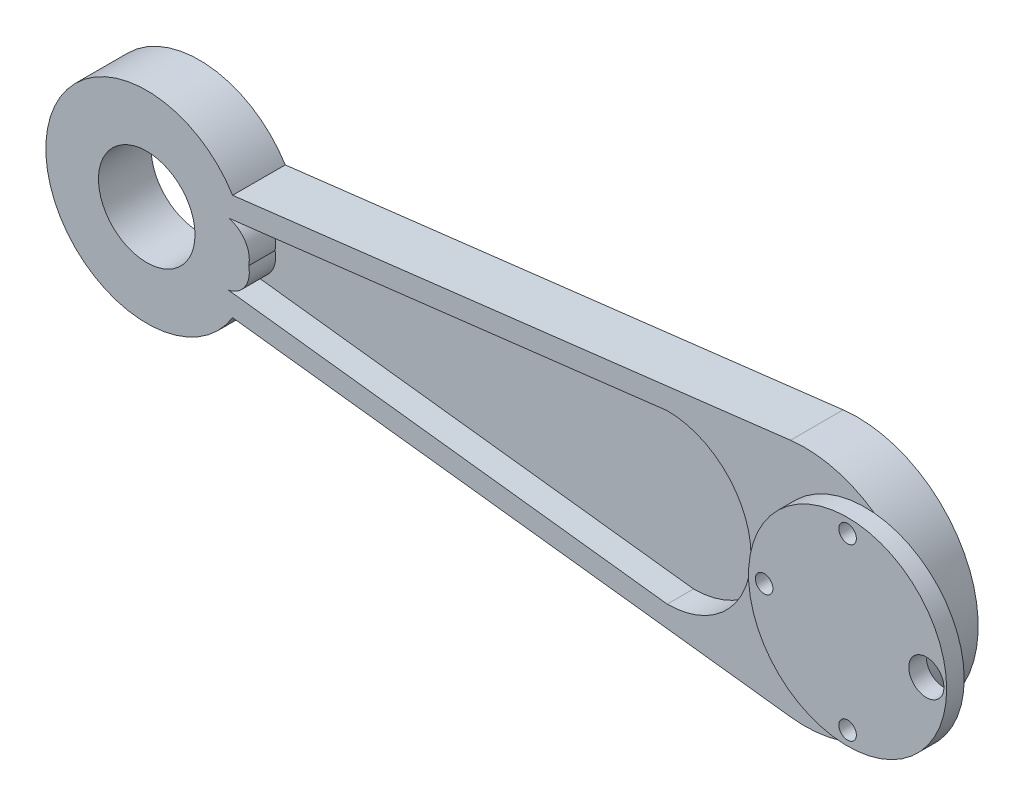
ISO-10303-21;
HEADER;
FILE_DESCRIPTION(('STEP AP214'),'2;1');
FILE_NAME('part.step','',(''),(''),'','','');
FILE_SCHEMA(('AUTOMOTIVE_DESIGN { 1 0 10303 214 1 1 1 1 }'));
ENDSEC;
DATA;
#1=APPLICATION_CONTEXT('core data for automotive mechanical design processes');
#2=APPLICATION_PROTOCOL_DEFINITION('international standard','automotive_design',2000,#1);
#3=PRODUCT_CONTEXT('',#1,'mechanical');
#4=PRODUCT('Part','Part','',(#3));
#5=PRODUCT_RELATED_PRODUCT_CATEGORY('part','',(#4));
#6=PRODUCT_DEFINITION_FORMATION('','',#4);
#7=PRODUCT_DEFINITION_CONTEXT('part definition',#1,'design');
#8=PRODUCT_DEFINITION('design','',#6,#7);
#9=PRODUCT_DEFINITION_SHAPE('','',#8);
#10=(LENGTH_UNIT() NAMED_UNIT(*) SI_UNIT(.MILLI.,.METRE.));
#11=(NAMED_UNIT(*) PLANE_ANGLE_UNIT() SI_UNIT($,.RADIAN.));
#12=(NAMED_UNIT(*) SI_UNIT($,.STERADIAN.) SOLID_ANGLE_UNIT());
#13=UNCERTAINTY_MEASURE_WITH_UNIT(LENGTH_MEASURE(1.E-05),#10,'distance_accuracy_value','');
#14=(GEOMETRIC_REPRESENTATION_CONTEXT(3) GLOBAL_UNCERTAINTY_ASSIGNED_CONTEXT((#13)) GLOBAL_UNIT_ASSIGNED_CONTEXT((#10,
#11,#12)) REPRESENTATION_CONTEXT('',''));
#15=CARTESIAN_POINT('',(0.,0.,0.));
#16=DIRECTION('',(0.,0.,1.));
#17=DIRECTION('',(1.,0.,0.));
#18=AXIS2_PLACEMENT_3D('',#15,#16,#17);
#19=CARTESIAN_POINT('',(9.69578719259024,0.,0.));
#20=DIRECTION('',(0.,0.,1.));
#21=DIRECTION('',(1.,0.,0.));
#22=AXIS2_PLACEMENT_3D('',#19,#20,#21);
#23=PLANE('',#22);
#24=CARTESIAN_POINT('',(9.69578719259024,0.,0.));
#25=DIRECTION('',(0.,0.,1.));
#26=DIRECTION('',(1.,0.,0.));
#27=AXIS2_PLACEMENT_3D('',#24,#25,#26);
#28=CIRCLE('',#27,27.5);
#29=CARTESIAN_POINT('',(6.42598445737751,-27.304915126636,0.));
#30=VERTEX_POINT('',#29);
#31=CARTESIAN_POINT('',(6.42598445737751,27.304915126636,0.));
#32=VERTEX_POINT('',#31);
#33=EDGE_CURVE('E182',#30,#32,#28,.T.);
#34=ORIENTED_EDGE('',*,*,#33,.F.);
#35=DIRECTION('',(0.992906004604945,-0.118901917644099,0.));
#36=VECTOR('',#35,1.);
#37=CARTESIAN_POINT('',(6.42598445737751,-27.304915126636,0.));
#38=LINE('',#37,#36);
#39=CARTESIAN_POINT('',(-120.730550627406,-12.0777377378,0.));
#40=VERTEX_POINT('',#39);
#41=EDGE_CURVE('E194',#40,#30,#38,.T.);
#42=ORIENTED_EDGE('',*,*,#41,.F.);
#43=CARTESIAN_POINT('',(-140.30421280741,0.,0.));
#44=DIRECTION('',(0.,0.,1.));
#45=DIRECTION('',(1.,0.,0.));
#46=AXIS2_PLACEMENT_3D('',#43,#44,#45);
#47=CIRCLE('',#46,23.);
#48=CARTESIAN_POINT('',(-120.730550627406,12.0777377378,0.));
#49=VERTEX_POINT('',#48);
#50=EDGE_CURVE('E192',#49,#40,#47,.T.);
#51=ORIENTED_EDGE('',*,*,#50,.F.);
#52=DIRECTION('',(-0.992906004604945,-0.118901917644099,0.));
#53=VECTOR('',#52,1.);
#54=CARTESIAN_POINT('',(6.42598445737751,27.304915126636,0.));
#55=LINE('',#54,#53);
#56=EDGE_CURVE('E190',#32,#49,#55,.T.);
#57=ORIENTED_EDGE('',*,*,#56,.F.);
#58=EDGE_LOOP('',(#34,#42,#51,#57));
#59=FACE_BOUND('',#58,.T.);
#60=CARTESIAN_POINT('',(-140.30421280741,0.,0.));
#61=DIRECTION('',(0.,0.,1.));
#62=DIRECTION('',(1.,0.,0.));
#63=AXIS2_PLACEMENT_3D('',#60,#61,#62);
#64=CIRCLE('',#63,11.);
#65=CARTESIAN_POINT('',(-129.30421280741,0.,0.));
#66=VERTEX_POINT('',#65);
#67=EDGE_CURVE('E142',#66,#66,#64,.T.);
#68=ORIENTED_EDGE('',*,*,#67,.T.);
#69=EDGE_LOOP('',(#68));
#70=FACE_BOUND('',#69,.T.);
#71=CARTESIAN_POINT('',(4.41668994822247,0.,0.));
#72=DIRECTION('',(0.,0.,1.));
#73=DIRECTION('',(1.,0.,0.));
#74=AXIS2_PLACEMENT_3D('',#71,#72,#73);
#75=CIRCLE('',#74,2.);
#76=CARTESIAN_POINT('',(6.41668994822247,0.,0.));
#77=VERTEX_POINT('',#76);
#78=EDGE_CURVE('E133',#77,#77,#75,.T.);
#79=ORIENTED_EDGE('',*,*,#78,.T.);
#80=EDGE_LOOP('',(#79));
#81=FACE_BOUND('',#80,.T.);
#82=CARTESIAN_POINT('',(23.4332464093947,19.3922579257773,0.));
#83=DIRECTION('',(0.,0.,-1.));
#84=DIRECTION('',(-1.,0.,0.));
#85=AXIS2_PLACEMENT_3D('',#82,#83,#84);
#86=CIRCLE('',#85,2.);
#87=CARTESIAN_POINT('',(21.4332464093947,19.3922579257773,0.));
#88=VERTEX_POINT('',#87);
#89=EDGE_CURVE('E294',#88,#88,#86,.T.);
#90=ORIENTED_EDGE('',*,*,#89,.F.);
#91=EDGE_LOOP('',(#90));
#92=FACE_BOUND('',#91,.T.);
#93=CARTESIAN_POINT('',(23.4332464093947,-19.3922579257773,0.));
#94=DIRECTION('',(0.,0.,1.));
#95=DIRECTION('',(1.,0.,0.));
#96=AXIS2_PLACEMENT_3D('',#93,#94,#95);
#97=CIRCLE('',#96,2.);
#98=CARTESIAN_POINT('',(25.4332464093947,-19.3922579257773,0.));
#99=VERTEX_POINT('',#98);
#100=EDGE_CURVE('E300',#99,#99,#97,.T.);
#101=ORIENTED_EDGE('',*,*,#100,.T.);
#102=EDGE_LOOP('',(#101));
#103=FACE_BOUND('',#102,.T.);
#104=ADVANCED_FACE('F35',(#59,#70,#81,#92,#103),#23,.F.);
#105=CARTESIAN_POINT('',(23.4332464093947,0.,16.));
#106=DIRECTION('',(0.,0.,1.));
#107=DIRECTION('',(1.,0.,0.));
#108=AXIS2_PLACEMENT_3D('',#105,#106,#107);
#109=PLANE('',#108);
#110=CARTESIAN_POINT('',(41.3772664111266,0.,16.));
#111=DIRECTION('',(0.,0.,1.));
#112=DIRECTION('',(1.,0.,0.));
#113=AXIS2_PLACEMENT_3D('',#110,#111,#112);
#114=CIRCLE('',#113,4.);
#115=CARTESIAN_POINT('',(45.3772664111266,0.,16.));
#116=VERTEX_POINT('',#115);
#117=EDGE_CURVE('E291',#116,#116,#114,.T.);
#118=ORIENTED_EDGE('',*,*,#117,.F.);
#119=EDGE_LOOP('',(#118));
#120=FACE_BOUND('',#119,.T.);
#121=CARTESIAN_POINT('',(23.4332464093947,19.3922579257773,16.));
#122=DIRECTION('',(0.,0.,-1.));
#123=DIRECTION('',(-1.,0.,0.));
#124=AXIS2_PLACEMENT_3D('',#121,#122,#123);
#125=CIRCLE('',#124,2.);
#126=CARTESIAN_POINT('',(21.4332464093947,19.3922579257773,16.));
#127=VERTEX_POINT('',#126);
#128=EDGE_CURVE('E296',#127,#127,#125,.T.);
#129=ORIENTED_EDGE('',*,*,#128,.T.);
#130=EDGE_LOOP('',(#129));
#131=FACE_BOUND('',#130,.T.);
#132=CARTESIAN_POINT('',(4.41668994822247,0.,16.));
#133=DIRECTION('',(0.,0.,1.));
#134=DIRECTION('',(1.,0.,0.));
#135=AXIS2_PLACEMENT_3D('',#132,#133,#134);
#136=CIRCLE('',#135,2.);
#137=CARTESIAN_POINT('',(6.41668994822247,0.,16.));
#138=VERTEX_POINT('',#137);
#139=EDGE_CURVE('E303',#138,#138,#136,.T.);
#140=ORIENTED_EDGE('',*,*,#139,.F.);
#141=EDGE_LOOP('',(#140));
#142=FACE_BOUND('',#141,.T.);
#143=CARTESIAN_POINT('',(23.4332464093947,0.,16.));
#144=DIRECTION('',(0.,0.,1.));
#145=DIRECTION('',(1.,0.,0.));
#146=AXIS2_PLACEMENT_3D('',#143,#144,#145);
#147=CIRCLE('',#146,22.579968685631);
#148=CARTESIAN_POINT('',(46.0132150950257,0.,16.));
#149=VERTEX_POINT('',#148);
#150=EDGE_CURVE('E136',#149,#149,#147,.T.);
#151=ORIENTED_EDGE('',*,*,#150,.T.);
#152=EDGE_LOOP('',(#151));
#153=FACE_BOUND('',#152,.T.);
#154=CARTESIAN_POINT('',(23.4332464093947,-19.3922579257773,16.));
#155=DIRECTION('',(0.,0.,1.));
#156=DIRECTION('',(1.,0.,0.));
#157=AXIS2_PLACEMENT_3D('',#154,#155,#156);
#158=CIRCLE('',#157,2.);
#159=CARTESIAN_POINT('',(25.4332464093947,-19.3922579257773,16.));
#160=VERTEX_POINT('',#159);
#161=EDGE_CURVE('E304',#160,#160,#158,.T.);
#162=ORIENTED_EDGE('',*,*,#161,.F.);
#163=EDGE_LOOP('',(#162));
#164=FACE_BOUND('',#163,.T.);
#165=ADVANCED_FACE('F223',(#120,#131,#142,#153,#164),#109,.T.);
#166=CARTESIAN_POINT('',(9.69578719259024,0.,12.));
#167=DIRECTION('',(0.,0.,1.));
#168=DIRECTION('',(1.,0.,0.));
#169=AXIS2_PLACEMENT_3D('',#166,#167,#168);
#170=PLANE('',#169);
#171=CARTESIAN_POINT('',(23.4332464093947,0.,12.));
#172=DIRECTION('',(0.,0.,1.));
#173=DIRECTION('',(1.,0.,0.));
#174=AXIS2_PLACEMENT_3D('',#171,#172,#173);
#175=CIRCLE('',#174,22.579968685631);
#176=CARTESIAN_POINT('',(25.5325148225815,22.4821720030221,12.));
#177=VERTEX_POINT('',#176);
#178=CARTESIAN_POINT('',(25.5325148225815,-22.4821720030221,12.));
#179=VERTEX_POINT('',#178);
#180=EDGE_CURVE('E51',#177,#179,#175,.T.);
#181=ORIENTED_EDGE('',*,*,#180,.F.);
#182=CARTESIAN_POINT('',(9.69578719259024,0.,12.));
#183=DIRECTION('',(0.,0.,1.));
#184=DIRECTION('',(1.,0.,0.));
#185=AXIS2_PLACEMENT_3D('',#182,#183,#184);
#186=CIRCLE('',#185,27.5);
#187=CARTESIAN_POINT('',(6.42598445737751,27.304915126636,12.));
#188=VERTEX_POINT('',#187);
#189=EDGE_CURVE('E123',#177,#188,#186,.T.);
#190=ORIENTED_EDGE('',*,*,#189,.T.);
#191=DIRECTION('',(-0.992906004604945,-0.118901917644099,0.));
#192=VECTOR('',#191,1.);
#193=CARTESIAN_POINT('',(6.42598445737751,27.304915126636,12.));
#194=LINE('',#193,#192);
#195=CARTESIAN_POINT('',(-120.730550627406,12.0777377378,12.));
#196=VERTEX_POINT('',#195);
#197=EDGE_CURVE('E120',#188,#196,#194,.T.);
#198=ORIENTED_EDGE('',*,*,#197,.T.);
#199=CARTESIAN_POINT('',(-140.30421280741,0.,12.));
#200=DIRECTION('',(0.,0.,1.));
#201=DIRECTION('',(1.,0.,0.));
#202=AXIS2_PLACEMENT_3D('',#199,#200,#201);
#203=CIRCLE('',#202,23.);
#204=CARTESIAN_POINT('',(-120.730550627406,-12.0777377378,12.));
#205=VERTEX_POINT('',#204);
#206=EDGE_CURVE('E185',#196,#205,#203,.T.);
#207=ORIENTED_EDGE('',*,*,#206,.T.);
#208=DIRECTION('',(0.992906004604945,-0.118901917644099,0.));
#209=VECTOR('',#208,1.);
#210=CARTESIAN_POINT('',(6.42598445737751,-27.304915126636,12.));
#211=LINE('',#210,#209);
#212=CARTESIAN_POINT('',(6.42598445737751,-27.304915126636,12.));
#213=VERTEX_POINT('',#212);
#214=EDGE_CURVE('E116',#205,#213,#211,.T.);
#215=ORIENTED_EDGE('',*,*,#214,.T.);
#216=EDGE_CURVE('E111',#213,#179,#186,.T.);
#217=ORIENTED_EDGE('',*,*,#216,.T.);
#218=EDGE_LOOP('',(#181,#190,#198,#207,#215,#217));
#219=FACE_BOUND('',#218,.T.);
#220=CARTESIAN_POINT('',(-140.30421280741,0.,12.));
#221=DIRECTION('',(0.,0.,1.));
#222=DIRECTION('',(1.,0.,0.));
#223=AXIS2_PLACEMENT_3D('',#220,#221,#222);
#224=CIRCLE('',#223,11.);
#225=CARTESIAN_POINT('',(-129.30421280741,0.,12.));
#226=VERTEX_POINT('',#225);
#227=EDGE_CURVE('E138',#226,#226,#224,.T.);
#228=ORIENTED_EDGE('',*,*,#227,.F.);
#229=EDGE_LOOP('',(#228));
#230=FACE_BOUND('',#229,.T.);
#231=DIRECTION('',(0.992906004604945,-0.118901917644099,0.));
#232=VECTOR('',#231,1.);
#233=CARTESIAN_POINT('',(-121.670322634586,-7.12237792326735,12.));
#234=LINE('',#233,#232);
#235=CARTESIAN_POINT('',(-121.670322634586,-7.12237792326735,12.));
#236=VERTEX_POINT('',#235);
#237=CARTESIAN_POINT('',(-21.6789657167423,-19.0964862781641,12.));
#238=VERTEX_POINT('',#237);
#239=EDGE_CURVE('E150',#236,#238,#234,.T.);
#240=ORIENTED_EDGE('',*,*,#239,.F.);
#241=CARTESIAN_POINT('',(-122.925918752607,-1.25559611802046,12.));
#242=DIRECTION('',(0.,0.,1.));
#243=DIRECTION('',(1.,0.,0.));
#244=AXIS2_PLACEMENT_3D('',#241,#242,#243);
#245=CIRCLE('',#244,5.99963751921431);
#246=CARTESIAN_POINT('',(-117.05913694736,0.,12.));
#247=VERTEX_POINT('',#246);
#248=EDGE_CURVE('E59',#236,#247,#245,.T.);
#249=ORIENTED_EDGE('',*,*,#248,.T.);
#250=CARTESIAN_POINT('',(-122.925918752607,1.25559611802046,12.));
#251=DIRECTION('',(0.,0.,-1.));
#252=DIRECTION('',(-1.,0.,0.));
#253=AXIS2_PLACEMENT_3D('',#250,#251,#252);
#254=CIRCLE('',#253,5.99963751921431);
#255=CARTESIAN_POINT('',(-121.670322634586,7.12237792326735,12.));
#256=VERTEX_POINT('',#255);
#257=EDGE_CURVE('E163',#256,#247,#254,.T.);
#258=ORIENTED_EDGE('',*,*,#257,.F.);
#259=DIRECTION('',(0.992906004604945,0.118901917644099,0.));
#260=VECTOR('',#259,1.);
#261=CARTESIAN_POINT('',(-121.670322634586,7.12237792326735,12.));
#262=LINE('',#261,#260);
#263=CARTESIAN_POINT('',(-21.6789657167423,19.0964862781641,12.));
#264=VERTEX_POINT('',#263);
#265=EDGE_CURVE('E166',#256,#264,#262,.T.);
#266=ORIENTED_EDGE('',*,*,#265,.T.);
#267=CARTESIAN_POINT('',(-21.6703226345828,0.,12.));
#268=DIRECTION('',(0.,0.,1.));
#269=DIRECTION('',(1.,0.,0.));
#270=AXIS2_PLACEMENT_3D('',#267,#268,#269);
#271=CIRCLE('',#270,19.0964882340963);
#272=EDGE_CURVE('E169',#238,#264,#271,.T.);
#273=ORIENTED_EDGE('',*,*,#272,.F.);
#274=EDGE_LOOP('',(#240,#249,#258,#266,#273));
#275=FACE_BOUND('',#274,.T.);
#276=ADVANCED_FACE('F113',(#219,#230,#275),#170,.T.);
#277=CARTESIAN_POINT('',(9.69578719259024,0.,12.));
#278=DIRECTION('',(0.,0.,-1.));
#279=DIRECTION('',(-1.,0.,0.));
#280=AXIS2_PLACEMENT_3D('',#277,#278,#279);
#281=CYLINDRICAL_SURFACE('',#280,27.5);
#282=ORIENTED_EDGE('',*,*,#33,.T.);
#283=DIRECTION('',(0.,0.,-1.));
#284=VECTOR('',#283,1.);
#285=CARTESIAN_POINT('',(6.42598445737751,27.304915126636,12.));
#286=LINE('',#285,#284);
#287=EDGE_CURVE('E11',#188,#32,#286,.T.);
#288=ORIENTED_EDGE('',*,*,#287,.F.);
#289=ORIENTED_EDGE('',*,*,#189,.F.);
#290=EDGE_CURVE('E121',#179,#177,#186,.T.);
#291=ORIENTED_EDGE('',*,*,#290,.F.);
#292=ORIENTED_EDGE('',*,*,#216,.F.);
#293=DIRECTION('',(0.,0.,-1.));
#294=VECTOR('',#293,1.);
#295=CARTESIAN_POINT('',(6.42598445737751,-27.304915126636,12.));
#296=LINE('',#295,#294);
#297=EDGE_CURVE('E188',#213,#30,#296,.T.);
#298=ORIENTED_EDGE('',*,*,#297,.T.);
#299=EDGE_LOOP('',(#282,#288,#289,#291,#292,#298));
#300=FACE_BOUND('',#299,.T.);
#301=ADVANCED_FACE('F37',(#300),#281,.T.);
#302=CARTESIAN_POINT('',(6.42598445737751,27.304915126636,12.));
#303=DIRECTION('',(0.118901917644099,-0.992906004604945,0.));
#304=DIRECTION('',(0.992906004604946,0.118901917644099,0.));
#305=AXIS2_PLACEMENT_3D('',#302,#303,#304);
#306=PLANE('',#305);
#307=ORIENTED_EDGE('',*,*,#56,.T.);
#308=DIRECTION('',(0.,0.,-1.));
#309=VECTOR('',#308,1.);
#310=CARTESIAN_POINT('',(-120.730550627406,12.0777377378,12.));
#311=LINE('',#310,#309);
#312=EDGE_CURVE('E44',#196,#49,#311,.T.);
#313=ORIENTED_EDGE('',*,*,#312,.F.);
#314=ORIENTED_EDGE('',*,*,#197,.F.);
#315=ORIENTED_EDGE('',*,*,#287,.T.);
#316=EDGE_LOOP('',(#307,#313,#314,#315));
#317=FACE_BOUND('',#316,.T.);
#318=ADVANCED_FACE('F215',(#317),#306,.F.);
#319=CARTESIAN_POINT('',(-140.30421280741,0.,12.));
#320=DIRECTION('',(0.,0.,-1.));
#321=DIRECTION('',(-1.,0.,0.));
#322=AXIS2_PLACEMENT_3D('',#319,#320,#321);
#323=CYLINDRICAL_SURFACE('',#322,23.);
#324=ORIENTED_EDGE('',*,*,#50,.T.);
#325=DIRECTION('',(0.,0.,-1.));
#326=VECTOR('',#325,1.);
#327=CARTESIAN_POINT('',(-120.730550627406,-12.0777377378,12.));
#328=LINE('',#327,#326);
#329=EDGE_CURVE('E197',#205,#40,#328,.T.);
#330=ORIENTED_EDGE('',*,*,#329,.F.);
#331=ORIENTED_EDGE('',*,*,#206,.F.);
#332=ORIENTED_EDGE('',*,*,#312,.T.);
#333=EDGE_LOOP('',(#324,#330,#331,#332));
#334=FACE_BOUND('',#333,.T.);
#335=ADVANCED_FACE('F205',(#334),#323,.T.);
#336=CARTESIAN_POINT('',(6.42598445737751,-27.304915126636,12.));
#337=DIRECTION('',(0.118901917644099,0.992906004604945,0.));
#338=DIRECTION('',(-0.992906004604946,0.118901917644099,0.));
#339=AXIS2_PLACEMENT_3D('',#336,#337,#338);
#340=PLANE('',#339);
#341=ORIENTED_EDGE('',*,*,#41,.T.);
#342=ORIENTED_EDGE('',*,*,#297,.F.);
#343=ORIENTED_EDGE('',*,*,#214,.F.);
#344=ORIENTED_EDGE('',*,*,#329,.T.);
#345=EDGE_LOOP('',(#341,#342,#343,#344));
#346=FACE_BOUND('',#345,.T.);
#347=ADVANCED_FACE('F214',(#346),#340,.F.);
#348=CARTESIAN_POINT('',(-122.925918752607,-1.25559611802046,6.));
#349=DIRECTION('',(0.,0.,1.));
#350=DIRECTION('',(1.,0.,0.));
#351=AXIS2_PLACEMENT_3D('',#348,#349,#350);
#352=CYLINDRICAL_SURFACE('',#351,5.99963751921431);
#353=ORIENTED_EDGE('',*,*,#248,.F.);
#354=DIRECTION('',(0.,0.,1.));
#355=VECTOR('',#354,1.);
#356=CARTESIAN_POINT('',(-121.670322634586,-7.12237792326735,6.));
#357=LINE('',#356,#355);
#358=CARTESIAN_POINT('',(-121.670322634586,-7.12237792326735,6.));
#359=VERTEX_POINT('',#358);
#360=EDGE_CURVE('E161',#359,#236,#357,.T.);
#361=ORIENTED_EDGE('',*,*,#360,.F.);
#362=CARTESIAN_POINT('',(-122.925918752607,-1.25559611802046,6.));
#363=DIRECTION('',(0.,0.,1.));
#364=DIRECTION('',(1.,0.,0.));
#365=AXIS2_PLACEMENT_3D('',#362,#363,#364);
#366=CIRCLE('',#365,5.99963751921431);
#367=CARTESIAN_POINT('',(-117.05913694736,0.,6.));
#368=VERTEX_POINT('',#367);
#369=EDGE_CURVE('E147',#359,#368,#366,.T.);
#370=ORIENTED_EDGE('',*,*,#369,.T.);
#371=DIRECTION('',(0.,0.,1.));
#372=VECTOR('',#371,1.);
#373=CARTESIAN_POINT('',(-117.05913694736,0.,6.));
#374=LINE('',#373,#372);
#375=EDGE_CURVE('E181',#368,#247,#374,.T.);
#376=ORIENTED_EDGE('',*,*,#375,.T.);
#377=EDGE_LOOP('',(#353,#361,#370,#376));
#378=FACE_BOUND('',#377,.T.);
#379=ADVANCED_FACE('F234',(#378),#352,.T.);
#380=CARTESIAN_POINT('',(-122.925918752607,1.25559611802046,6.));
#381=DIRECTION('',(0.,0.,1.));
#382=DIRECTION('',(1.,0.,0.));
#383=AXIS2_PLACEMENT_3D('',#380,#381,#382);
#384=CYLINDRICAL_SURFACE('',#383,5.99963751921431);
#385=ORIENTED_EDGE('',*,*,#257,.T.);
#386=ORIENTED_EDGE('',*,*,#375,.F.);
#387=CARTESIAN_POINT('',(-122.925918752607,1.25559611802046,6.));
#388=DIRECTION('',(0.,0.,-1.));
#389=DIRECTION('',(-1.,0.,0.));
#390=AXIS2_PLACEMENT_3D('',#387,#388,#389);
#391=CIRCLE('',#390,5.99963751921431);
#392=CARTESIAN_POINT('',(-121.670322634586,7.12237792326735,6.));
#393=VERTEX_POINT('',#392);
#394=EDGE_CURVE('E149',#393,#368,#391,.T.);
#395=ORIENTED_EDGE('',*,*,#394,.F.);
#396=DIRECTION('',(0.,0.,1.));
#397=VECTOR('',#396,1.);
#398=CARTESIAN_POINT('',(-121.670322634586,7.12237792326735,6.));
#399=LINE('',#398,#397);
#400=EDGE_CURVE('E179',#393,#256,#399,.T.);
#401=ORIENTED_EDGE('',*,*,#400,.T.);
#402=EDGE_LOOP('',(#385,#386,#395,#401));
#403=FACE_BOUND('',#402,.T.);
#404=ADVANCED_FACE('F238',(#403),#384,.T.);
#405=CARTESIAN_POINT('',(-121.670322634586,7.12237792326735,6.));
#406=DIRECTION('',(0.118901917644099,-0.992906004604945,0.));
#407=DIRECTION('',(0.992906004604945,0.118901917644099,0.));
#408=AXIS2_PLACEMENT_3D('',#405,#406,#407);
#409=PLANE('',#408);
#410=ORIENTED_EDGE('',*,*,#265,.F.);
#411=ORIENTED_EDGE('',*,*,#400,.F.);
#412=DIRECTION('',(0.992906004604945,0.118901917644099,0.));
#413=VECTOR('',#412,1.);
#414=CARTESIAN_POINT('',(-121.670322634586,7.12237792326735,6.));
#415=LINE('',#414,#413);
#416=CARTESIAN_POINT('',(-21.6789657167423,19.0964862781641,6.));
#417=VERTEX_POINT('',#416);
#418=EDGE_CURVE('E153',#393,#417,#415,.T.);
#419=ORIENTED_EDGE('',*,*,#418,.T.);
#420=DIRECTION('',(0.,0.,1.));
#421=VECTOR('',#420,1.);
#422=CARTESIAN_POINT('',(-21.6789657167423,19.0964862781641,6.));
#423=LINE('',#422,#421);
#424=EDGE_CURVE('E177',#417,#264,#423,.T.);
#425=ORIENTED_EDGE('',*,*,#424,.T.);
#426=EDGE_LOOP('',(#410,#411,#419,#425));
#427=FACE_BOUND('',#426,.T.);
#428=ADVANCED_FACE('F242',(#427),#409,.T.);
#429=CARTESIAN_POINT('',(-21.6703226345828,0.,6.));
#430=DIRECTION('',(0.,0.,1.));
#431=DIRECTION('',(1.,0.,0.));
#432=AXIS2_PLACEMENT_3D('',#429,#430,#431);
#433=CYLINDRICAL_SURFACE('',#432,19.0964882340963);
#434=ORIENTED_EDGE('',*,*,#272,.T.);
#435=ORIENTED_EDGE('',*,*,#424,.F.);
#436=CARTESIAN_POINT('',(-21.6703226345828,0.,6.));
#437=DIRECTION('',(0.,0.,1.));
#438=DIRECTION('',(1.,0.,0.));
#439=AXIS2_PLACEMENT_3D('',#436,#437,#438);
#440=CIRCLE('',#439,19.0964882340963);
#441=CARTESIAN_POINT('',(-21.6789657167423,-19.0964862781641,6.));
#442=VERTEX_POINT('',#441);
#443=EDGE_CURVE('E155',#442,#417,#440,.T.);
#444=ORIENTED_EDGE('',*,*,#443,.F.);
#445=DIRECTION('',(0.,0.,1.));
#446=VECTOR('',#445,1.);
#447=CARTESIAN_POINT('',(-21.6789657167423,-19.0964862781641,6.));
#448=LINE('',#447,#446);
#449=EDGE_CURVE('E175',#442,#238,#448,.T.);
#450=ORIENTED_EDGE('',*,*,#449,.T.);
#451=EDGE_LOOP('',(#434,#435,#444,#450));
#452=FACE_BOUND('',#451,.T.);
#453=ADVANCED_FACE('F248',(#452),#433,.F.);
#454=CARTESIAN_POINT('',(-121.670322634586,-7.12237792326735,6.));
#455=DIRECTION('',(-0.118901917644099,-0.992906004604945,0.));
#456=DIRECTION('',(0.992906004604945,-0.118901917644099,0.));
#457=AXIS2_PLACEMENT_3D('',#454,#455,#456);
#458=PLANE('',#457);
#459=ORIENTED_EDGE('',*,*,#239,.T.);
#460=ORIENTED_EDGE('',*,*,#449,.F.);
#461=DIRECTION('',(0.992906004604945,-0.118901917644099,0.));
#462=VECTOR('',#461,1.);
#463=CARTESIAN_POINT('',(-121.670322634586,-7.12237792326735,6.));
#464=LINE('',#463,#462);
#465=EDGE_CURVE('E158',#359,#442,#464,.T.);
#466=ORIENTED_EDGE('',*,*,#465,.F.);
#467=ORIENTED_EDGE('',*,*,#360,.T.);
#468=EDGE_LOOP('',(#459,#460,#466,#467));
#469=FACE_BOUND('',#468,.T.);
#470=ADVANCED_FACE('F252',(#469),#458,.F.);
#471=CARTESIAN_POINT('',(-122.925918752607,-1.25559611802046,6.));
#472=DIRECTION('',(0.,0.,1.));
#473=DIRECTION('',(1.,0.,0.));
#474=AXIS2_PLACEMENT_3D('',#471,#472,#473);
#475=PLANE('',#474);
#476=ORIENTED_EDGE('',*,*,#369,.F.);
#477=ORIENTED_EDGE('',*,*,#465,.T.);
#478=ORIENTED_EDGE('',*,*,#443,.T.);
#479=ORIENTED_EDGE('',*,*,#418,.F.);
#480=ORIENTED_EDGE('',*,*,#394,.T.);
#481=EDGE_LOOP('',(#476,#477,#478,#479,#480));
#482=FACE_BOUND('',#481,.T.);
#483=ADVANCED_FACE('F256',(#482),#475,.T.);
#484=CARTESIAN_POINT('',(-140.30421280741,0.,0.));
#485=DIRECTION('',(0.,0.,1.));
#486=DIRECTION('',(1.,0.,0.));
#487=AXIS2_PLACEMENT_3D('',#484,#485,#486);
#488=CYLINDRICAL_SURFACE('',#487,11.);
#489=ORIENTED_EDGE('',*,*,#67,.F.);
#490=EDGE_LOOP('',(#489));
#491=FACE_BOUND('',#490,.T.);
#492=ORIENTED_EDGE('',*,*,#227,.T.);
#493=EDGE_LOOP('',(#492));
#494=FACE_BOUND('',#493,.T.);
#495=ADVANCED_FACE('F260',(#491,#494),#488,.F.);
#496=CARTESIAN_POINT('',(23.4332464093947,0.,12.));
#497=DIRECTION('',(0.,0.,1.));
#498=DIRECTION('',(1.,0.,0.));
#499=AXIS2_PLACEMENT_3D('',#496,#497,#498);
#500=PLANE('',#499);
#501=CARTESIAN_POINT('',(41.3772664111266,0.,12.));
#502=DIRECTION('',(0.,0.,1.));
#503=DIRECTION('',(1.,0.,0.));
#504=AXIS2_PLACEMENT_3D('',#501,#502,#503);
#505=CIRCLE('',#504,4.);
#506=CARTESIAN_POINT('',(45.3772664111266,0.,12.));
#507=VERTEX_POINT('',#506);
#508=EDGE_CURVE('E39',#507,#507,#505,.T.);
#509=ORIENTED_EDGE('',*,*,#508,.T.);
#510=EDGE_LOOP('',(#509));
#511=FACE_BOUND('',#510,.T.);
#512=EDGE_CURVE('E130',#179,#177,#175,.T.);
#513=ORIENTED_EDGE('',*,*,#512,.F.);
#514=ORIENTED_EDGE('',*,*,#290,.T.);
#515=EDGE_LOOP('',(#513,#514));
#516=FACE_BOUND('',#515,.T.);
#517=ADVANCED_FACE('F131',(#511,#516),#500,.F.);
#518=CARTESIAN_POINT('',(23.4332464093947,0.,16.));
#519=DIRECTION('',(0.,0.,-1.));
#520=DIRECTION('',(-1.,0.,0.));
#521=AXIS2_PLACEMENT_3D('',#518,#519,#520);
#522=CYLINDRICAL_SURFACE('',#521,22.579968685631);
#523=ORIENTED_EDGE('',*,*,#150,.F.);
#524=EDGE_LOOP('',(#523));
#525=FACE_BOUND('',#524,.T.);
#526=ORIENTED_EDGE('',*,*,#180,.T.);
#527=ORIENTED_EDGE('',*,*,#512,.T.);
#528=EDGE_LOOP('',(#526,#527));
#529=FACE_BOUND('',#528,.T.);
#530=ADVANCED_FACE('F135',(#525,#529),#522,.T.);
#531=CARTESIAN_POINT('',(4.41668994822247,0.,0.));
#532=DIRECTION('',(0.,0.,1.));
#533=DIRECTION('',(1.,0.,0.));
#534=AXIS2_PLACEMENT_3D('',#531,#532,#533);
#535=CYLINDRICAL_SURFACE('',#534,2.);
#536=ORIENTED_EDGE('',*,*,#78,.F.);
#537=EDGE_LOOP('',(#536));
#538=FACE_BOUND('',#537,.T.);
#539=ORIENTED_EDGE('',*,*,#139,.T.);
#540=EDGE_LOOP('',(#539));
#541=FACE_BOUND('',#540,.T.);
#542=ADVANCED_FACE('F267',(#538,#541),#535,.F.);
#543=CARTESIAN_POINT('',(23.4332464093947,19.3922579257773,0.));
#544=DIRECTION('',(0.,0.,1.));
#545=DIRECTION('',(1.,0.,0.));
#546=AXIS2_PLACEMENT_3D('',#543,#544,#545);
#547=CYLINDRICAL_SURFACE('',#546,2.);
#548=ORIENTED_EDGE('',*,*,#89,.T.);
#549=EDGE_LOOP('',(#548));
#550=FACE_BOUND('',#549,.T.);
#551=ORIENTED_EDGE('',*,*,#128,.F.);
#552=EDGE_LOOP('',(#551));
#553=FACE_BOUND('',#552,.T.);
#554=ADVANCED_FACE('F274',(#550,#553),#547,.F.);
#555=CARTESIAN_POINT('',(23.4332464093947,-19.3922579257773,0.));
#556=DIRECTION('',(0.,0.,1.));
#557=DIRECTION('',(1.,0.,0.));
#558=AXIS2_PLACEMENT_3D('',#555,#556,#557);
#559=CYLINDRICAL_SURFACE('',#558,2.);
#560=ORIENTED_EDGE('',*,*,#100,.F.);
#561=EDGE_LOOP('',(#560));
#562=FACE_BOUND('',#561,.T.);
#563=ORIENTED_EDGE('',*,*,#161,.T.);
#564=EDGE_LOOP('',(#563));
#565=FACE_BOUND('',#564,.T.);
#566=ADVANCED_FACE('F278',(#562,#565),#559,.F.);
#567=CARTESIAN_POINT('',(41.3772664111266,0.,0.));
#568=DIRECTION('',(0.,0.,1.));
#569=DIRECTION('',(1.,0.,0.));
#570=AXIS2_PLACEMENT_3D('',#567,#568,#569);
#571=CYLINDRICAL_SURFACE('',#570,4.);
#572=ORIENTED_EDGE('',*,*,#117,.T.);
#573=EDGE_LOOP('',(#572));
#574=FACE_BOUND('',#573,.T.);
#575=ORIENTED_EDGE('',*,*,#508,.F.);
#576=EDGE_LOOP('',(#575));
#577=FACE_BOUND('',#576,.T.);
#578=ADVANCED_FACE('F282',(#574,#577),#571,.F.);
#579=CLOSED_SHELL('',(#104,#165,#276,#301,#318,#335,#347,#379,#404,#428,#453,#470,#483,#495,
#517,#530,#542,#554,#566,#578));
#580=MANIFOLD_SOLID_BREP('B2',#579);
#581=ADVANCED_BREP_SHAPE_REPRESENTATION('',(#18,#580),#14);
#582=SHAPE_DEFINITION_REPRESENTATION(#9,#581);
ENDSEC;
END-ISO-10303-21;
